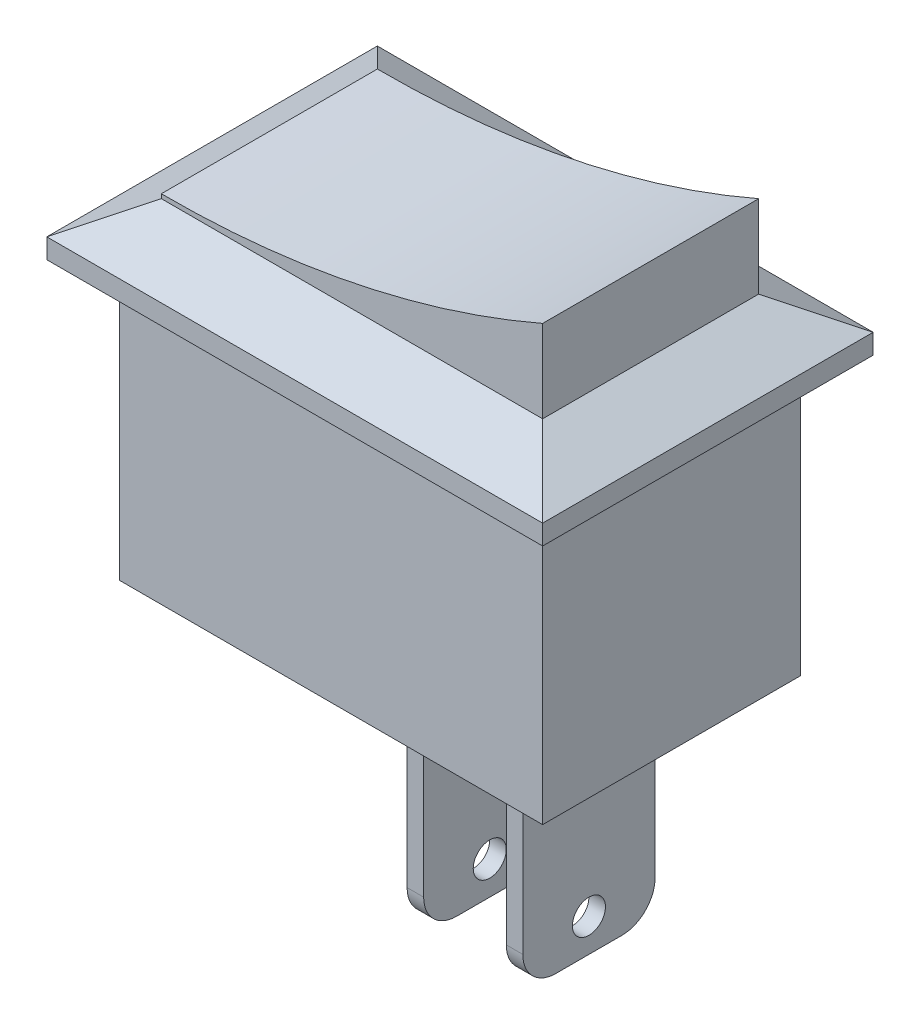
ISO-10303-21;
HEADER;
FILE_DESCRIPTION(('STEP AP214'),'2;1');
FILE_NAME('part.step','',(''),(''),'','','');
FILE_SCHEMA(('AUTOMOTIVE_DESIGN { 1 0 10303 214 1 1 1 1 }'));
ENDSEC;
DATA;
#1=APPLICATION_CONTEXT('core data for automotive mechanical design processes');
#2=APPLICATION_PROTOCOL_DEFINITION('international standard','automotive_design',2000,#1);
#3=PRODUCT_CONTEXT('',#1,'mechanical');
#4=PRODUCT('Part','Part','',(#3));
#5=PRODUCT_RELATED_PRODUCT_CATEGORY('part','',(#4));
#6=PRODUCT_DEFINITION_FORMATION('','',#4);
#7=PRODUCT_DEFINITION_CONTEXT('part definition',#1,'design');
#8=PRODUCT_DEFINITION('design','',#6,#7);
#9=PRODUCT_DEFINITION_SHAPE('','',#8);
#10=(LENGTH_UNIT() NAMED_UNIT(*) SI_UNIT(.MILLI.,.METRE.));
#11=(NAMED_UNIT(*) PLANE_ANGLE_UNIT() SI_UNIT($,.RADIAN.));
#12=(NAMED_UNIT(*) SI_UNIT($,.STERADIAN.) SOLID_ANGLE_UNIT());
#13=UNCERTAINTY_MEASURE_WITH_UNIT(LENGTH_MEASURE(1.E-05),#10,'distance_accuracy_value','');
#14=(GEOMETRIC_REPRESENTATION_CONTEXT(3) GLOBAL_UNCERTAINTY_ASSIGNED_CONTEXT((#13)) GLOBAL_UNIT_ASSIGNED_CONTEXT((#10,
#11,#12)) REPRESENTATION_CONTEXT('',''));
#15=CARTESIAN_POINT('',(0.,0.,0.));
#16=DIRECTION('',(0.,0.,1.));
#17=DIRECTION('',(1.,0.,0.));
#18=AXIS2_PLACEMENT_3D('',#15,#16,#17);
#19=CARTESIAN_POINT('',(-5.76794919243113,12.5,3.26794919243113));
#20=DIRECTION('',(0.,0.,-1.));
#21=DIRECTION('',(-1.,0.,0.));
#22=AXIS2_PLACEMENT_3D('',#19,#20,#21);
#23=PLANE('',#22);
#24=CARTESIAN_POINT('',(-5.62710581970251,38.6897927994851,3.26794919243113));
#25=DIRECTION('',(0.,0.,-1.));
#26=DIRECTION('',(-1.,0.,0.));
#27=AXIS2_PLACEMENT_3D('',#24,#25,#26);
#28=CIRCLE('',#27,28.5613817174435);
#29=CARTESIAN_POINT('',(-5.76794919243111,10.1287583512395,3.26794919243115));
#30=VERTEX_POINT('',#29);
#31=CARTESIAN_POINT('',(5.76794919243114,12.5,3.26794919243115));
#32=VERTEX_POINT('',#31);
#33=EDGE_CURVE('E207',#30,#32,#28,.F.);
#34=ORIENTED_EDGE('',*,*,#33,.F.);
#35=DIRECTION('',(0.,-1.,0.));
#36=VECTOR('',#35,1.);
#37=CARTESIAN_POINT('',(-5.76794919243113,12.5,3.26794919243113));
#38=LINE('',#37,#36);
#39=CARTESIAN_POINT('',(-5.76794919243113,10.,3.26794919243113));
#40=VERTEX_POINT('',#39);
#41=EDGE_CURVE('E226',#30,#40,#38,.T.);
#42=ORIENTED_EDGE('',*,*,#41,.T.);
#43=DIRECTION('',(1.,0.,0.));
#44=VECTOR('',#43,1.);
#45=CARTESIAN_POINT('',(0.,10.,3.26794919243113));
#46=LINE('',#45,#44);
#47=CARTESIAN_POINT('',(5.76794919243113,10.,3.26794919243113));
#48=VERTEX_POINT('',#47);
#49=EDGE_CURVE('E222',#40,#48,#46,.T.);
#50=ORIENTED_EDGE('',*,*,#49,.T.);
#51=DIRECTION('',(0.,-1.,0.));
#52=VECTOR('',#51,1.);
#53=CARTESIAN_POINT('',(5.76794919243113,12.5,3.26794919243113));
#54=LINE('',#53,#52);
#55=EDGE_CURVE('E220',#32,#48,#54,.T.);
#56=ORIENTED_EDGE('',*,*,#55,.F.);
#57=EDGE_LOOP('',(#34,#42,#50,#56));
#58=FACE_BOUND('',#57,.T.);
#59=ADVANCED_FACE('F45',(#58),#23,.F.);
#60=CARTESIAN_POINT('',(0.,0.,0.));
#61=DIRECTION('',(0.,-1.,0.));
#62=DIRECTION('',(0.,0.,-1.));
#63=AXIS2_PLACEMENT_3D('',#60,#61,#62);
#64=PLANE('',#63);
#65=DIRECTION('',(1.,0.,0.));
#66=VECTOR('',#65,1.);
#67=CARTESIAN_POINT('',(-6.4,0.,-3.9));
#68=LINE('',#67,#66);
#69=CARTESIAN_POINT('',(-6.4,0.,-3.9));
#70=VERTEX_POINT('',#69);
#71=CARTESIAN_POINT('',(6.4,0.,-3.9));
#72=VERTEX_POINT('',#71);
#73=EDGE_CURVE('E337',#70,#72,#68,.T.);
#74=ORIENTED_EDGE('',*,*,#73,.T.);
#75=DIRECTION('',(0.,0.,1.));
#76=VECTOR('',#75,1.);
#77=CARTESIAN_POINT('',(6.4,0.,-3.9));
#78=LINE('',#77,#76);
#79=CARTESIAN_POINT('',(6.4,0.,3.9));
#80=VERTEX_POINT('',#79);
#81=EDGE_CURVE('E350',#72,#80,#78,.T.);
#82=ORIENTED_EDGE('',*,*,#81,.T.);
#83=DIRECTION('',(-1.,0.,0.));
#84=VECTOR('',#83,1.);
#85=CARTESIAN_POINT('',(-6.4,0.,3.9));
#86=LINE('',#85,#84);
#87=CARTESIAN_POINT('',(-6.4,0.,3.9));
#88=VERTEX_POINT('',#87);
#89=EDGE_CURVE('E354',#80,#88,#86,.T.);
#90=ORIENTED_EDGE('',*,*,#89,.T.);
#91=DIRECTION('',(0.,0.,-1.));
#92=VECTOR('',#91,1.);
#93=CARTESIAN_POINT('',(-6.4,0.,-3.9));
#94=LINE('',#93,#92);
#95=EDGE_CURVE('E359',#88,#70,#94,.T.);
#96=ORIENTED_EDGE('',*,*,#95,.T.);
#97=EDGE_LOOP('',(#74,#82,#90,#96));
#98=FACE_BOUND('',#97,.T.);
#99=DIRECTION('',(1.,0.,0.));
#100=VECTOR('',#99,1.);
#101=CARTESIAN_POINT('',(3.4,0.,2.));
#102=LINE('',#101,#100);
#103=CARTESIAN_POINT('',(3.4,0.,2.));
#104=VERTEX_POINT('',#103);
#105=CARTESIAN_POINT('',(3.9,0.,2.));
#106=VERTEX_POINT('',#105);
#107=EDGE_CURVE('E309',#104,#106,#102,.T.);
#108=ORIENTED_EDGE('',*,*,#107,.T.);
#109=DIRECTION('',(0.,0.,1.));
#110=VECTOR('',#109,1.);
#111=CARTESIAN_POINT('',(3.9,0.,-2.));
#112=LINE('',#111,#110);
#113=CARTESIAN_POINT('',(3.9,0.,-2.));
#114=VERTEX_POINT('',#113);
#115=EDGE_CURVE('E295',#114,#106,#112,.T.);
#116=ORIENTED_EDGE('',*,*,#115,.F.);
#117=DIRECTION('',(-1.,0.,0.));
#118=VECTOR('',#117,1.);
#119=CARTESIAN_POINT('',(3.9,0.,-2.));
#120=LINE('',#119,#118);
#121=CARTESIAN_POINT('',(3.4,0.,-2.));
#122=VERTEX_POINT('',#121);
#123=EDGE_CURVE('E301',#114,#122,#120,.T.);
#124=ORIENTED_EDGE('',*,*,#123,.T.);
#125=DIRECTION('',(0.,0.,1.));
#126=VECTOR('',#125,1.);
#127=CARTESIAN_POINT('',(3.4,0.,-2.));
#128=LINE('',#127,#126);
#129=EDGE_CURVE('E313',#122,#104,#128,.T.);
#130=ORIENTED_EDGE('',*,*,#129,.T.);
#131=EDGE_LOOP('',(#108,#116,#124,#130));
#132=FACE_BOUND('',#131,.T.);
#133=DIRECTION('',(1.,0.,0.));
#134=VECTOR('',#133,1.);
#135=CARTESIAN_POINT('',(0.400000000000002,0.,1.99999999999998));
#136=LINE('',#135,#134);
#137=CARTESIAN_POINT('',(0.400000000000002,0.,1.99999999999998));
#138=VERTEX_POINT('',#137);
#139=CARTESIAN_POINT('',(0.900000000000002,0.,1.99999999999998));
#140=VERTEX_POINT('',#139);
#141=EDGE_CURVE('E273',#138,#140,#136,.T.);
#142=ORIENTED_EDGE('',*,*,#141,.T.);
#143=DIRECTION('',(0.,0.,1.));
#144=VECTOR('',#143,1.);
#145=CARTESIAN_POINT('',(0.900000000000002,0.,-2.00000000000002));
#146=LINE('',#145,#144);
#147=CARTESIAN_POINT('',(0.900000000000002,0.,-2.00000000000002));
#148=VERTEX_POINT('',#147);
#149=EDGE_CURVE('E260',#148,#140,#146,.T.);
#150=ORIENTED_EDGE('',*,*,#149,.F.);
#151=DIRECTION('',(-1.,0.,0.));
#152=VECTOR('',#151,1.);
#153=CARTESIAN_POINT('',(0.900000000000002,0.,-2.00000000000002));
#154=LINE('',#153,#152);
#155=CARTESIAN_POINT('',(0.400000000000002,0.,-2.00000000000002));
#156=VERTEX_POINT('',#155);
#157=EDGE_CURVE('E265',#148,#156,#154,.T.);
#158=ORIENTED_EDGE('',*,*,#157,.T.);
#159=DIRECTION('',(0.,0.,1.));
#160=VECTOR('',#159,1.);
#161=CARTESIAN_POINT('',(0.400000000000002,0.,-2.00000000000002));
#162=LINE('',#161,#160);
#163=EDGE_CURVE('E277',#156,#138,#162,.T.);
#164=ORIENTED_EDGE('',*,*,#163,.T.);
#165=EDGE_LOOP('',(#142,#150,#158,#164));
#166=FACE_BOUND('',#165,.T.);
#167=ADVANCED_FACE('F502',(#98,#132,#166),#64,.T.);
#168=CARTESIAN_POINT('',(7.5,10.,5.));
#169=DIRECTION('',(-1.,0.,0.));
#170=DIRECTION('',(0.,0.,1.));
#171=AXIS2_PLACEMENT_3D('',#168,#169,#170);
#172=PLANE('',#171);
#173=DIRECTION('',(0.,-1.,0.));
#174=VECTOR('',#173,1.);
#175=CARTESIAN_POINT('',(7.5,10.,-5.));
#176=LINE('',#175,#174);
#177=CARTESIAN_POINT('',(7.5,9.,-5.));
#178=VERTEX_POINT('',#177);
#179=CARTESIAN_POINT('',(7.5,8.4,-5.));
#180=VERTEX_POINT('',#179);
#181=EDGE_CURVE('E403',#178,#180,#176,.T.);
#182=ORIENTED_EDGE('',*,*,#181,.F.);
#183=DIRECTION('',(0.,0.,1.));
#184=VECTOR('',#183,1.);
#185=CARTESIAN_POINT('',(7.5,9.,5.));
#186=LINE('',#185,#184);
#187=CARTESIAN_POINT('',(7.5,9.,5.));
#188=VERTEX_POINT('',#187);
#189=EDGE_CURVE('E426',#178,#188,#186,.T.);
#190=ORIENTED_EDGE('',*,*,#189,.T.);
#191=DIRECTION('',(0.,-1.,0.));
#192=VECTOR('',#191,1.);
#193=CARTESIAN_POINT('',(7.5,10.,5.));
#194=LINE('',#193,#192);
#195=CARTESIAN_POINT('',(7.5,8.4,5.));
#196=VERTEX_POINT('',#195);
#197=EDGE_CURVE('E394',#188,#196,#194,.T.);
#198=ORIENTED_EDGE('',*,*,#197,.T.);
#199=DIRECTION('',(0.,0.,1.));
#200=VECTOR('',#199,1.);
#201=CARTESIAN_POINT('',(7.5,8.4,-5.));
#202=LINE('',#201,#200);
#203=EDGE_CURVE('E369',#180,#196,#202,.T.);
#204=ORIENTED_EDGE('',*,*,#203,.F.);
#205=EDGE_LOOP('',(#182,#190,#198,#204));
#206=FACE_BOUND('',#205,.T.);
#207=ADVANCED_FACE('F532',(#206),#172,.F.);
#208=CARTESIAN_POINT('',(-7.5,10.,-5.));
#209=DIRECTION('',(0.,0.,1.));
#210=DIRECTION('',(1.,0.,0.));
#211=AXIS2_PLACEMENT_3D('',#208,#209,#210);
#212=PLANE('',#211);
#213=DIRECTION('',(0.,-1.,0.));
#214=VECTOR('',#213,1.);
#215=CARTESIAN_POINT('',(-7.5,10.,-5.));
#216=LINE('',#215,#214);
#217=CARTESIAN_POINT('',(-7.5,9.,-5.));
#218=VERTEX_POINT('',#217);
#219=CARTESIAN_POINT('',(-7.5,8.4,-5.));
#220=VERTEX_POINT('',#219);
#221=EDGE_CURVE('E400',#218,#220,#216,.T.);
#222=ORIENTED_EDGE('',*,*,#221,.F.);
#223=DIRECTION('',(1.,0.,0.));
#224=VECTOR('',#223,1.);
#225=CARTESIAN_POINT('',(-7.5,9.,-5.));
#226=LINE('',#225,#224);
#227=EDGE_CURVE('E429',#218,#178,#226,.T.);
#228=ORIENTED_EDGE('',*,*,#227,.T.);
#229=ORIENTED_EDGE('',*,*,#181,.T.);
#230=DIRECTION('',(1.,0.,0.));
#231=VECTOR('',#230,1.);
#232=CARTESIAN_POINT('',(-7.5,8.4,-5.));
#233=LINE('',#232,#231);
#234=EDGE_CURVE('E390',#220,#180,#233,.T.);
#235=ORIENTED_EDGE('',*,*,#234,.F.);
#236=EDGE_LOOP('',(#222,#228,#229,#235));
#237=FACE_BOUND('',#236,.T.);
#238=ADVANCED_FACE('F607',(#237),#212,.F.);
#239=CARTESIAN_POINT('',(-7.5,10.,5.));
#240=DIRECTION('',(1.,0.,0.));
#241=DIRECTION('',(0.,0.,-1.));
#242=AXIS2_PLACEMENT_3D('',#239,#240,#241);
#243=PLANE('',#242);
#244=DIRECTION('',(0.,-1.,0.));
#245=VECTOR('',#244,1.);
#246=CARTESIAN_POINT('',(-7.5,10.,5.));
#247=LINE('',#246,#245);
#248=CARTESIAN_POINT('',(-7.5,9.,5.));
#249=VERTEX_POINT('',#248);
#250=CARTESIAN_POINT('',(-7.5,8.4,5.));
#251=VERTEX_POINT('',#250);
#252=EDGE_CURVE('E397',#249,#251,#247,.T.);
#253=ORIENTED_EDGE('',*,*,#252,.F.);
#254=DIRECTION('',(0.,0.,-1.));
#255=VECTOR('',#254,1.);
#256=CARTESIAN_POINT('',(-7.5,9.,5.));
#257=LINE('',#256,#255);
#258=EDGE_CURVE('E419',#249,#218,#257,.T.);
#259=ORIENTED_EDGE('',*,*,#258,.T.);
#260=ORIENTED_EDGE('',*,*,#221,.T.);
#261=DIRECTION('',(0.,0.,-1.));
#262=VECTOR('',#261,1.);
#263=CARTESIAN_POINT('',(-7.5,8.4,-5.));
#264=LINE('',#263,#262);
#265=EDGE_CURVE('E386',#251,#220,#264,.T.);
#266=ORIENTED_EDGE('',*,*,#265,.F.);
#267=EDGE_LOOP('',(#253,#259,#260,#266));
#268=FACE_BOUND('',#267,.T.);
#269=ADVANCED_FACE('F603',(#268),#243,.F.);
#270=CARTESIAN_POINT('',(-7.5,10.,5.));
#271=DIRECTION('',(0.,0.,-1.));
#272=DIRECTION('',(-1.,0.,0.));
#273=AXIS2_PLACEMENT_3D('',#270,#271,#272);
#274=PLANE('',#273);
#275=ORIENTED_EDGE('',*,*,#197,.F.);
#276=DIRECTION('',(-1.,0.,0.));
#277=VECTOR('',#276,1.);
#278=CARTESIAN_POINT('',(-7.5,9.,5.));
#279=LINE('',#278,#277);
#280=EDGE_CURVE('E423',#188,#249,#279,.T.);
#281=ORIENTED_EDGE('',*,*,#280,.T.);
#282=ORIENTED_EDGE('',*,*,#252,.T.);
#283=DIRECTION('',(-1.,0.,0.));
#284=VECTOR('',#283,1.);
#285=CARTESIAN_POINT('',(-7.5,8.4,5.));
#286=LINE('',#285,#284);
#287=EDGE_CURVE('E382',#196,#251,#286,.T.);
#288=ORIENTED_EDGE('',*,*,#287,.F.);
#289=EDGE_LOOP('',(#275,#281,#282,#288));
#290=FACE_BOUND('',#289,.T.);
#291=ADVANCED_FACE('F598',(#290),#274,.F.);
#292=CARTESIAN_POINT('',(0.,8.4,0.));
#293=DIRECTION('',(0.,1.,0.));
#294=DIRECTION('',(0.,0.,1.));
#295=AXIS2_PLACEMENT_3D('',#292,#293,#294);
#296=PLANE('',#295);
#297=DIRECTION('',(0.,0.,1.));
#298=VECTOR('',#297,1.);
#299=CARTESIAN_POINT('',(6.4,8.4,-3.9));
#300=LINE('',#299,#298);
#301=CARTESIAN_POINT('',(6.4,8.4,-3.9));
#302=VERTEX_POINT('',#301);
#303=CARTESIAN_POINT('',(6.4,8.4,3.9));
#304=VERTEX_POINT('',#303);
#305=EDGE_CURVE('E332',#302,#304,#300,.T.);
#306=ORIENTED_EDGE('',*,*,#305,.F.);
#307=DIRECTION('',(1.,0.,0.));
#308=VECTOR('',#307,1.);
#309=CARTESIAN_POINT('',(-6.4,8.4,-3.9));
#310=LINE('',#309,#308);
#311=CARTESIAN_POINT('',(-6.4,8.4,-3.9));
#312=VERTEX_POINT('',#311);
#313=EDGE_CURVE('E345',#312,#302,#310,.T.);
#314=ORIENTED_EDGE('',*,*,#313,.F.);
#315=DIRECTION('',(0.,0.,-1.));
#316=VECTOR('',#315,1.);
#317=CARTESIAN_POINT('',(-6.4,8.4,-3.9));
#318=LINE('',#317,#316);
#319=CARTESIAN_POINT('',(-6.4,8.4,3.9));
#320=VERTEX_POINT('',#319);
#321=EDGE_CURVE('E341',#320,#312,#318,.T.);
#322=ORIENTED_EDGE('',*,*,#321,.F.);
#323=DIRECTION('',(-1.,0.,0.));
#324=VECTOR('',#323,1.);
#325=CARTESIAN_POINT('',(-6.4,8.4,3.9));
#326=LINE('',#325,#324);
#327=EDGE_CURVE('E336',#304,#320,#326,.T.);
#328=ORIENTED_EDGE('',*,*,#327,.F.);
#329=EDGE_LOOP('',(#306,#314,#322,#328));
#330=FACE_BOUND('',#329,.T.);
#331=ORIENTED_EDGE('',*,*,#203,.T.);
#332=ORIENTED_EDGE('',*,*,#287,.T.);
#333=ORIENTED_EDGE('',*,*,#265,.T.);
#334=ORIENTED_EDGE('',*,*,#234,.T.);
#335=EDGE_LOOP('',(#331,#332,#333,#334));
#336=FACE_BOUND('',#335,.T.);
#337=ADVANCED_FACE('F595',(#330,#336),#296,.F.);
#338=CARTESIAN_POINT('',(6.4,8.4,-3.9));
#339=DIRECTION('',(1.,0.,0.));
#340=DIRECTION('',(0.,0.,-1.));
#341=AXIS2_PLACEMENT_3D('',#338,#339,#340);
#342=PLANE('',#341);
#343=ORIENTED_EDGE('',*,*,#81,.F.);
#344=DIRECTION('',(0.,-1.,0.));
#345=VECTOR('',#344,1.);
#346=CARTESIAN_POINT('',(6.4,8.4,-3.9));
#347=LINE('',#346,#345);
#348=EDGE_CURVE('E366',#302,#72,#347,.T.);
#349=ORIENTED_EDGE('',*,*,#348,.F.);
#350=ORIENTED_EDGE('',*,*,#305,.T.);
#351=DIRECTION('',(0.,-1.,0.));
#352=VECTOR('',#351,1.);
#353=CARTESIAN_POINT('',(6.4,8.4,3.9));
#354=LINE('',#353,#352);
#355=EDGE_CURVE('E349',#304,#80,#354,.T.);
#356=ORIENTED_EDGE('',*,*,#355,.T.);
#357=EDGE_LOOP('',(#343,#349,#350,#356));
#358=FACE_BOUND('',#357,.T.);
#359=ADVANCED_FACE('F583',(#358),#342,.T.);
#360=CARTESIAN_POINT('',(-6.4,8.4,-3.9));
#361=DIRECTION('',(0.,0.,-1.));
#362=DIRECTION('',(-1.,0.,0.));
#363=AXIS2_PLACEMENT_3D('',#360,#361,#362);
#364=PLANE('',#363);
#365=ORIENTED_EDGE('',*,*,#73,.F.);
#366=DIRECTION('',(0.,-1.,0.));
#367=VECTOR('',#366,1.);
#368=CARTESIAN_POINT('',(-6.4,8.4,-3.9));
#369=LINE('',#368,#367);
#370=EDGE_CURVE('E370',#312,#70,#369,.T.);
#371=ORIENTED_EDGE('',*,*,#370,.F.);
#372=ORIENTED_EDGE('',*,*,#313,.T.);
#373=ORIENTED_EDGE('',*,*,#348,.T.);
#374=EDGE_LOOP('',(#365,#371,#372,#373));
#375=FACE_BOUND('',#374,.T.);
#376=ADVANCED_FACE('F579',(#375),#364,.T.);
#377=CARTESIAN_POINT('',(-6.4,8.4,-3.9));
#378=DIRECTION('',(-1.,0.,0.));
#379=DIRECTION('',(0.,0.,1.));
#380=AXIS2_PLACEMENT_3D('',#377,#378,#379);
#381=PLANE('',#380);
#382=ORIENTED_EDGE('',*,*,#95,.F.);
#383=DIRECTION('',(0.,-1.,0.));
#384=VECTOR('',#383,1.);
#385=CARTESIAN_POINT('',(-6.4,8.4,3.9));
#386=LINE('',#385,#384);
#387=EDGE_CURVE('E373',#320,#88,#386,.T.);
#388=ORIENTED_EDGE('',*,*,#387,.F.);
#389=ORIENTED_EDGE('',*,*,#321,.T.);
#390=ORIENTED_EDGE('',*,*,#370,.T.);
#391=EDGE_LOOP('',(#382,#388,#389,#390));
#392=FACE_BOUND('',#391,.T.);
#393=ADVANCED_FACE('F582',(#392),#381,.T.);
#394=CARTESIAN_POINT('',(-6.4,8.4,3.9));
#395=DIRECTION('',(0.,0.,1.));
#396=DIRECTION('',(1.,0.,0.));
#397=AXIS2_PLACEMENT_3D('',#394,#395,#396);
#398=PLANE('',#397);
#399=ORIENTED_EDGE('',*,*,#89,.F.);
#400=ORIENTED_EDGE('',*,*,#355,.F.);
#401=ORIENTED_EDGE('',*,*,#327,.T.);
#402=ORIENTED_EDGE('',*,*,#387,.T.);
#403=EDGE_LOOP('',(#399,#400,#401,#402));
#404=FACE_BOUND('',#403,.T.);
#405=ADVANCED_FACE('F587',(#404),#398,.T.);
#406=CARTESIAN_POINT('',(5.76794919243113,10.,0.));
#407=DIRECTION('',(-0.500000000000002,-0.866025403784438,0.));
#408=DIRECTION('',(0.,0.,-1.));
#409=AXIS2_PLACEMENT_3D('',#406,#407,#408);
#410=PLANE('',#409);
#411=DIRECTION('',(0.654653670707977,-0.377964473009229,0.654653670707977));
#412=VECTOR('',#411,1.);
#413=CARTESIAN_POINT('',(4.36739953853207,10.8086077196921,1.86739953853208));
#414=LINE('',#413,#412);
#415=EDGE_CURVE('E439',#188,#48,#414,.F.);
#416=ORIENTED_EDGE('',*,*,#415,.F.);
#417=ORIENTED_EDGE('',*,*,#189,.F.);
#418=DIRECTION('',(0.654653670707977,-0.377964473009229,-0.654653670707977));
#419=VECTOR('',#418,1.);
#420=CARTESIAN_POINT('',(3.2959709671035,11.4271972938238,-0.795970967103504));
#421=LINE('',#420,#419);
#422=CARTESIAN_POINT('',(5.76794919243113,10.,-3.26794919243113));
#423=VERTEX_POINT('',#422);
#424=EDGE_CURVE('E355',#423,#178,#421,.T.);
#425=ORIENTED_EDGE('',*,*,#424,.F.);
#426=DIRECTION('',(0.,0.,-1.));
#427=VECTOR('',#426,1.);
#428=CARTESIAN_POINT('',(5.76794919243113,10.,0.));
#429=LINE('',#428,#427);
#430=EDGE_CURVE('E410',#48,#423,#429,.T.);
#431=ORIENTED_EDGE('',*,*,#430,.F.);
#432=EDGE_LOOP('',(#416,#417,#425,#431));
#433=FACE_BOUND('',#432,.T.);
#434=ADVANCED_FACE('F591',(#433),#410,.F.);
#435=CARTESIAN_POINT('',(0.,10.,-3.26794919243113));
#436=DIRECTION('',(0.,-0.866025403784438,0.500000000000002));
#437=DIRECTION('',(-1.,0.,0.));
#438=AXIS2_PLACEMENT_3D('',#435,#436,#437);
#439=PLANE('',#438);
#440=ORIENTED_EDGE('',*,*,#424,.T.);
#441=ORIENTED_EDGE('',*,*,#227,.F.);
#442=DIRECTION('',(0.654653670707977,0.377964473009229,0.654653670707977));
#443=VECTOR('',#442,1.);
#444=CARTESIAN_POINT('',(-3.2959709671035,11.4271972938238,-0.795970967103504));
#445=LINE('',#444,#443);
#446=CARTESIAN_POINT('',(-5.76794919243113,10.,-3.26794919243113));
#447=VERTEX_POINT('',#446);
#448=EDGE_CURVE('E436',#447,#218,#445,.F.);
#449=ORIENTED_EDGE('',*,*,#448,.F.);
#450=DIRECTION('',(-1.,0.,0.));
#451=VECTOR('',#450,1.);
#452=CARTESIAN_POINT('',(0.,10.,-3.26794919243113));
#453=LINE('',#452,#451);
#454=EDGE_CURVE('E406',#423,#447,#453,.T.);
#455=ORIENTED_EDGE('',*,*,#454,.F.);
#456=EDGE_LOOP('',(#440,#441,#449,#455));
#457=FACE_BOUND('',#456,.T.);
#458=ADVANCED_FACE('F628',(#457),#439,.F.);
#459=CARTESIAN_POINT('',(0.,10.,3.26794919243113));
#460=DIRECTION('',(0.,-0.866025403784438,-0.500000000000002));
#461=DIRECTION('',(1.,0.,0.));
#462=AXIS2_PLACEMENT_3D('',#459,#460,#461);
#463=PLANE('',#462);
#464=ORIENTED_EDGE('',*,*,#415,.T.);
#465=ORIENTED_EDGE('',*,*,#49,.F.);
#466=DIRECTION('',(-0.654653670707977,-0.377964473009229,0.654653670707977));
#467=VECTOR('',#466,1.);
#468=CARTESIAN_POINT('',(-3.2959709671035,11.4271972938238,0.795970967103506));
#469=LINE('',#468,#467);
#470=EDGE_CURVE('E331',#249,#40,#469,.F.);
#471=ORIENTED_EDGE('',*,*,#470,.F.);
#472=ORIENTED_EDGE('',*,*,#280,.F.);
#473=EDGE_LOOP('',(#464,#465,#471,#472));
#474=FACE_BOUND('',#473,.T.);
#475=ADVANCED_FACE('F621',(#474),#463,.F.);
#476=CARTESIAN_POINT('',(-5.76794919243113,10.,0.));
#477=DIRECTION('',(0.500000000000002,-0.866025403784438,0.));
#478=DIRECTION('',(0.,0.,1.));
#479=AXIS2_PLACEMENT_3D('',#476,#477,#478);
#480=PLANE('',#479);
#481=ORIENTED_EDGE('',*,*,#448,.T.);
#482=ORIENTED_EDGE('',*,*,#258,.F.);
#483=ORIENTED_EDGE('',*,*,#470,.T.);
#484=DIRECTION('',(0.,0.,1.));
#485=VECTOR('',#484,1.);
#486=CARTESIAN_POINT('',(-5.76794919243113,10.,0.));
#487=LINE('',#486,#485);
#488=EDGE_CURVE('E415',#447,#40,#487,.T.);
#489=ORIENTED_EDGE('',*,*,#488,.F.);
#490=EDGE_LOOP('',(#481,#482,#483,#489));
#491=FACE_BOUND('',#490,.T.);
#492=ADVANCED_FACE('F577',(#491),#480,.F.);
#493=CARTESIAN_POINT('',(3.9,-6.6,-2.));
#494=DIRECTION('',(-1.,0.,0.));
#495=DIRECTION('',(0.,0.,1.));
#496=AXIS2_PLACEMENT_3D('',#493,#494,#495);
#497=PLANE('',#496);
#498=CARTESIAN_POINT('',(3.9,-5.6,0.));
#499=DIRECTION('',(-1.,0.,0.));
#500=DIRECTION('',(0.,0.,1.));
#501=AXIS2_PLACEMENT_3D('',#498,#499,#500);
#502=CIRCLE('',#501,0.5);
#503=CARTESIAN_POINT('',(3.9,-5.6,0.499999999999979));
#504=VERTEX_POINT('',#503);
#505=EDGE_CURVE('E256',#504,#504,#502,.T.);
#506=ORIENTED_EDGE('',*,*,#505,.T.);
#507=EDGE_LOOP('',(#506));
#508=FACE_BOUND('',#507,.T.);
#509=DIRECTION('',(0.,0.,1.));
#510=VECTOR('',#509,1.);
#511=CARTESIAN_POINT('',(3.9,-6.6,-2.));
#512=LINE('',#511,#510);
#513=CARTESIAN_POINT('',(3.9,-6.6,-1.));
#514=VERTEX_POINT('',#513);
#515=CARTESIAN_POINT('',(3.9,-6.6,1.));
#516=VERTEX_POINT('',#515);
#517=EDGE_CURVE('E296',#514,#516,#512,.T.);
#518=ORIENTED_EDGE('',*,*,#517,.F.);
#519=CARTESIAN_POINT('',(3.9,-5.6,-1.));
#520=DIRECTION('',(-1.,0.,0.));
#521=DIRECTION('',(0.,0.,1.));
#522=AXIS2_PLACEMENT_3D('',#519,#520,#521);
#523=CIRCLE('',#522,1.);
#524=CARTESIAN_POINT('',(3.9,-5.6,-2.));
#525=VERTEX_POINT('',#524);
#526=EDGE_CURVE('E464',#514,#525,#523,.F.);
#527=ORIENTED_EDGE('',*,*,#526,.T.);
#528=DIRECTION('',(0.,1.,0.));
#529=VECTOR('',#528,1.);
#530=CARTESIAN_POINT('',(3.9,-6.6,-2.));
#531=LINE('',#530,#529);
#532=EDGE_CURVE('E305',#525,#114,#531,.T.);
#533=ORIENTED_EDGE('',*,*,#532,.T.);
#534=ORIENTED_EDGE('',*,*,#115,.T.);
#535=DIRECTION('',(0.,1.,0.));
#536=VECTOR('',#535,1.);
#537=CARTESIAN_POINT('',(3.9,-6.6,2.));
#538=LINE('',#537,#536);
#539=CARTESIAN_POINT('',(3.9,-5.6,2.));
#540=VERTEX_POINT('',#539);
#541=EDGE_CURVE('E328',#540,#106,#538,.T.);
#542=ORIENTED_EDGE('',*,*,#541,.F.);
#543=CARTESIAN_POINT('',(3.9,-5.6,1.));
#544=DIRECTION('',(-1.,0.,0.));
#545=DIRECTION('',(0.,0.,1.));
#546=AXIS2_PLACEMENT_3D('',#543,#544,#545);
#547=CIRCLE('',#546,1.);
#548=EDGE_CURVE('E461',#540,#516,#547,.F.);
#549=ORIENTED_EDGE('',*,*,#548,.T.);
#550=EDGE_LOOP('',(#518,#527,#533,#534,#542,#549));
#551=FACE_BOUND('',#550,.T.);
#552=ADVANCED_FACE('F573',(#508,#551),#497,.F.);
#553=CARTESIAN_POINT('',(3.4,-6.6,2.));
#554=DIRECTION('',(0.,0.,1.));
#555=DIRECTION('',(1.,0.,0.));
#556=AXIS2_PLACEMENT_3D('',#553,#554,#555);
#557=PLANE('',#556);
#558=DIRECTION('',(0.,1.,0.));
#559=VECTOR('',#558,1.);
#560=CARTESIAN_POINT('',(3.4,-6.6,2.));
#561=LINE('',#560,#559);
#562=CARTESIAN_POINT('',(3.4,-5.6,2.));
#563=VERTEX_POINT('',#562);
#564=EDGE_CURVE('E325',#563,#104,#561,.T.);
#565=ORIENTED_EDGE('',*,*,#564,.F.);
#566=DIRECTION('',(1.,0.,0.));
#567=VECTOR('',#566,1.);
#568=CARTESIAN_POINT('',(3.9,-5.6,2.));
#569=LINE('',#568,#567);
#570=EDGE_CURVE('E467',#563,#540,#569,.T.);
#571=ORIENTED_EDGE('',*,*,#570,.T.);
#572=ORIENTED_EDGE('',*,*,#541,.T.);
#573=ORIENTED_EDGE('',*,*,#107,.F.);
#574=EDGE_LOOP('',(#565,#571,#572,#573));
#575=FACE_BOUND('',#574,.T.);
#576=ADVANCED_FACE('F569',(#575),#557,.T.);
#577=CARTESIAN_POINT('',(3.4,-6.6,-2.));
#578=DIRECTION('',(-1.,0.,0.));
#579=DIRECTION('',(0.,0.,1.));
#580=AXIS2_PLACEMENT_3D('',#577,#578,#579);
#581=PLANE('',#580);
#582=CARTESIAN_POINT('',(3.4,-5.6,0.));
#583=DIRECTION('',(-1.,0.,0.));
#584=DIRECTION('',(0.,0.,1.));
#585=AXIS2_PLACEMENT_3D('',#582,#583,#584);
#586=CIRCLE('',#585,0.5);
#587=CARTESIAN_POINT('',(3.4,-5.6,0.499999999999979));
#588=VERTEX_POINT('',#587);
#589=EDGE_CURVE('E252',#588,#588,#586,.T.);
#590=ORIENTED_EDGE('',*,*,#589,.F.);
#591=EDGE_LOOP('',(#590));
#592=FACE_BOUND('',#591,.T.);
#593=DIRECTION('',(0.,1.,0.));
#594=VECTOR('',#593,1.);
#595=CARTESIAN_POINT('',(3.4,-6.6,-2.));
#596=LINE('',#595,#594);
#597=CARTESIAN_POINT('',(3.4,-5.6,-2.));
#598=VERTEX_POINT('',#597);
#599=EDGE_CURVE('E322',#598,#122,#596,.T.);
#600=ORIENTED_EDGE('',*,*,#599,.F.);
#601=CARTESIAN_POINT('',(3.4,-5.6,-1.));
#602=DIRECTION('',(-1.,0.,0.));
#603=DIRECTION('',(0.,0.,1.));
#604=AXIS2_PLACEMENT_3D('',#601,#602,#603);
#605=CIRCLE('',#604,1.);
#606=CARTESIAN_POINT('',(3.4,-6.6,-1.));
#607=VERTEX_POINT('',#606);
#608=EDGE_CURVE('E452',#598,#607,#605,.T.);
#609=ORIENTED_EDGE('',*,*,#608,.T.);
#610=DIRECTION('',(0.,0.,1.));
#611=VECTOR('',#610,1.);
#612=CARTESIAN_POINT('',(3.4,-6.6,-2.));
#613=LINE('',#612,#611);
#614=CARTESIAN_POINT('',(3.4,-6.6,1.));
#615=VERTEX_POINT('',#614);
#616=EDGE_CURVE('E300',#607,#615,#613,.T.);
#617=ORIENTED_EDGE('',*,*,#616,.T.);
#618=CARTESIAN_POINT('',(3.4,-5.6,1.));
#619=DIRECTION('',(-1.,0.,0.));
#620=DIRECTION('',(0.,0.,1.));
#621=AXIS2_PLACEMENT_3D('',#618,#619,#620);
#622=CIRCLE('',#621,1.);
#623=EDGE_CURVE('E449',#615,#563,#622,.T.);
#624=ORIENTED_EDGE('',*,*,#623,.T.);
#625=ORIENTED_EDGE('',*,*,#564,.T.);
#626=ORIENTED_EDGE('',*,*,#129,.F.);
#627=EDGE_LOOP('',(#600,#609,#617,#624,#625,#626));
#628=FACE_BOUND('',#627,.T.);
#629=ADVANCED_FACE('F565',(#592,#628),#581,.T.);
#630=CARTESIAN_POINT('',(3.9,-6.6,-2.));
#631=DIRECTION('',(0.,0.,-1.));
#632=DIRECTION('',(-1.,0.,0.));
#633=AXIS2_PLACEMENT_3D('',#630,#631,#632);
#634=PLANE('',#633);
#635=ORIENTED_EDGE('',*,*,#532,.F.);
#636=DIRECTION('',(-1.,0.,0.));
#637=VECTOR('',#636,1.);
#638=CARTESIAN_POINT('',(3.4,-5.6,-2.));
#639=LINE('',#638,#637);
#640=EDGE_CURVE('E432',#525,#598,#639,.T.);
#641=ORIENTED_EDGE('',*,*,#640,.T.);
#642=ORIENTED_EDGE('',*,*,#599,.T.);
#643=ORIENTED_EDGE('',*,*,#123,.F.);
#644=EDGE_LOOP('',(#635,#641,#642,#643));
#645=FACE_BOUND('',#644,.T.);
#646=ADVANCED_FACE('F561',(#645),#634,.T.);
#647=CARTESIAN_POINT('',(0.,-6.6,0.));
#648=DIRECTION('',(0.,1.,0.));
#649=DIRECTION('',(-1.,0.,0.));
#650=AXIS2_PLACEMENT_3D('',#647,#648,#649);
#651=PLANE('',#650);
#652=ORIENTED_EDGE('',*,*,#616,.F.);
#653=DIRECTION('',(-1.,0.,0.));
#654=VECTOR('',#653,1.);
#655=CARTESIAN_POINT('',(3.9,-6.6,-1.));
#656=LINE('',#655,#654);
#657=EDGE_CURVE('E458',#607,#514,#656,.F.);
#658=ORIENTED_EDGE('',*,*,#657,.T.);
#659=ORIENTED_EDGE('',*,*,#517,.T.);
#660=DIRECTION('',(1.,0.,0.));
#661=VECTOR('',#660,1.);
#662=CARTESIAN_POINT('',(3.4,-6.6,1.));
#663=LINE('',#662,#661);
#664=EDGE_CURVE('E455',#516,#615,#663,.F.);
#665=ORIENTED_EDGE('',*,*,#664,.T.);
#666=EDGE_LOOP('',(#652,#658,#659,#665));
#667=FACE_BOUND('',#666,.T.);
#668=ADVANCED_FACE('F557',(#667),#651,.F.);
#669=CARTESIAN_POINT('',(0.900000000000002,-6.6,-2.00000000000002));
#670=DIRECTION('',(-1.,0.,0.));
#671=DIRECTION('',(0.,0.,1.));
#672=AXIS2_PLACEMENT_3D('',#669,#670,#671);
#673=PLANE('',#672);
#674=CARTESIAN_POINT('',(0.900000000000002,-5.6,0.));
#675=DIRECTION('',(-1.,0.,0.));
#676=DIRECTION('',(0.,0.,1.));
#677=AXIS2_PLACEMENT_3D('',#674,#675,#676);
#678=CIRCLE('',#677,0.5);
#679=CARTESIAN_POINT('',(0.900000000000002,-5.6,0.499999999999979));
#680=VERTEX_POINT('',#679);
#681=EDGE_CURVE('E248',#680,#680,#678,.T.);
#682=ORIENTED_EDGE('',*,*,#681,.T.);
#683=EDGE_LOOP('',(#682));
#684=FACE_BOUND('',#683,.T.);
#685=DIRECTION('',(0.,0.,1.));
#686=VECTOR('',#685,1.);
#687=CARTESIAN_POINT('',(0.900000000000002,-6.6,-2.00000000000002));
#688=LINE('',#687,#686);
#689=CARTESIAN_POINT('',(0.900000000000002,-6.6,-1.00000000000002));
#690=VERTEX_POINT('',#689);
#691=CARTESIAN_POINT('',(0.900000000000002,-6.6,0.999999999999979));
#692=VERTEX_POINT('',#691);
#693=EDGE_CURVE('E261',#690,#692,#688,.T.);
#694=ORIENTED_EDGE('',*,*,#693,.F.);
#695=CARTESIAN_POINT('',(0.900000000000002,-5.6,-1.00000000000002));
#696=DIRECTION('',(-1.,0.,0.));
#697=DIRECTION('',(0.,0.,1.));
#698=AXIS2_PLACEMENT_3D('',#695,#696,#697);
#699=CIRCLE('',#698,1.);
#700=CARTESIAN_POINT('',(0.900000000000002,-5.6,-2.00000000000002));
#701=VERTEX_POINT('',#700);
#702=EDGE_CURVE('E489',#690,#701,#699,.F.);
#703=ORIENTED_EDGE('',*,*,#702,.T.);
#704=DIRECTION('',(0.,1.,0.));
#705=VECTOR('',#704,1.);
#706=CARTESIAN_POINT('',(0.900000000000002,-6.6,-2.00000000000002));
#707=LINE('',#706,#705);
#708=EDGE_CURVE('E269',#701,#148,#707,.T.);
#709=ORIENTED_EDGE('',*,*,#708,.T.);
#710=ORIENTED_EDGE('',*,*,#149,.T.);
#711=DIRECTION('',(0.,1.,0.));
#712=VECTOR('',#711,1.);
#713=CARTESIAN_POINT('',(0.900000000000002,-6.6,1.99999999999998));
#714=LINE('',#713,#712);
#715=CARTESIAN_POINT('',(0.900000000000002,-5.6,1.99999999999998));
#716=VERTEX_POINT('',#715);
#717=EDGE_CURVE('E292',#716,#140,#714,.T.);
#718=ORIENTED_EDGE('',*,*,#717,.F.);
#719=CARTESIAN_POINT('',(0.900000000000002,-5.6,0.999999999999979));
#720=DIRECTION('',(-1.,0.,0.));
#721=DIRECTION('',(0.,0.,1.));
#722=AXIS2_PLACEMENT_3D('',#719,#720,#721);
#723=CIRCLE('',#722,1.);
#724=EDGE_CURVE('E61',#716,#692,#723,.F.);
#725=ORIENTED_EDGE('',*,*,#724,.T.);
#726=EDGE_LOOP('',(#694,#703,#709,#710,#718,#725));
#727=FACE_BOUND('',#726,.T.);
#728=ADVANCED_FACE('F497',(#684,#727),#673,.F.);
#729=CARTESIAN_POINT('',(0.400000000000002,-6.6,1.99999999999998));
#730=DIRECTION('',(0.,0.,1.));
#731=DIRECTION('',(1.,0.,0.));
#732=AXIS2_PLACEMENT_3D('',#729,#730,#731);
#733=PLANE('',#732);
#734=DIRECTION('',(0.,1.,0.));
#735=VECTOR('',#734,1.);
#736=CARTESIAN_POINT('',(0.400000000000002,-6.6,1.99999999999998));
#737=LINE('',#736,#735);
#738=CARTESIAN_POINT('',(0.400000000000002,-5.6,1.99999999999998));
#739=VERTEX_POINT('',#738);
#740=EDGE_CURVE('E289',#739,#138,#737,.T.);
#741=ORIENTED_EDGE('',*,*,#740,.F.);
#742=DIRECTION('',(1.,0.,0.));
#743=VECTOR('',#742,1.);
#744=CARTESIAN_POINT('',(0.900000000000002,-5.6,1.99999999999998));
#745=LINE('',#744,#743);
#746=EDGE_CURVE('E54',#739,#716,#745,.T.);
#747=ORIENTED_EDGE('',*,*,#746,.T.);
#748=ORIENTED_EDGE('',*,*,#717,.T.);
#749=ORIENTED_EDGE('',*,*,#141,.F.);
#750=EDGE_LOOP('',(#741,#747,#748,#749));
#751=FACE_BOUND('',#750,.T.);
#752=ADVANCED_FACE('F494',(#751),#733,.T.);
#753=CARTESIAN_POINT('',(0.400000000000002,-6.6,-2.00000000000002));
#754=DIRECTION('',(-1.,0.,0.));
#755=DIRECTION('',(0.,0.,1.));
#756=AXIS2_PLACEMENT_3D('',#753,#754,#755);
#757=PLANE('',#756);
#758=CARTESIAN_POINT('',(0.400000000000002,-5.6,0.));
#759=DIRECTION('',(-1.,0.,0.));
#760=DIRECTION('',(0.,0.,1.));
#761=AXIS2_PLACEMENT_3D('',#758,#759,#760);
#762=CIRCLE('',#761,0.5);
#763=CARTESIAN_POINT('',(0.400000000000002,-5.6,0.499999999999979));
#764=VERTEX_POINT('',#763);
#765=EDGE_CURVE('E244',#764,#764,#762,.T.);
#766=ORIENTED_EDGE('',*,*,#765,.F.);
#767=EDGE_LOOP('',(#766));
#768=FACE_BOUND('',#767,.T.);
#769=DIRECTION('',(0.,1.,0.));
#770=VECTOR('',#769,1.);
#771=CARTESIAN_POINT('',(0.400000000000002,-6.6,-2.00000000000002));
#772=LINE('',#771,#770);
#773=CARTESIAN_POINT('',(0.400000000000002,-5.6,-2.00000000000002));
#774=VERTEX_POINT('',#773);
#775=EDGE_CURVE('E286',#774,#156,#772,.T.);
#776=ORIENTED_EDGE('',*,*,#775,.F.);
#777=CARTESIAN_POINT('',(0.400000000000002,-5.6,-1.00000000000002));
#778=DIRECTION('',(-1.,0.,0.));
#779=DIRECTION('',(0.,0.,1.));
#780=AXIS2_PLACEMENT_3D('',#777,#778,#779);
#781=CIRCLE('',#780,1.);
#782=CARTESIAN_POINT('',(0.400000000000002,-6.6,-1.00000000000002));
#783=VERTEX_POINT('',#782);
#784=EDGE_CURVE('E478',#774,#783,#781,.T.);
#785=ORIENTED_EDGE('',*,*,#784,.T.);
#786=DIRECTION('',(0.,0.,1.));
#787=VECTOR('',#786,1.);
#788=CARTESIAN_POINT('',(0.400000000000002,-6.6,-2.00000000000002));
#789=LINE('',#788,#787);
#790=CARTESIAN_POINT('',(0.400000000000002,-6.6,0.999999999999979));
#791=VERTEX_POINT('',#790);
#792=EDGE_CURVE('E264',#783,#791,#789,.T.);
#793=ORIENTED_EDGE('',*,*,#792,.T.);
#794=CARTESIAN_POINT('',(0.400000000000002,-5.6,0.999999999999979));
#795=DIRECTION('',(-1.,0.,0.));
#796=DIRECTION('',(0.,0.,1.));
#797=AXIS2_PLACEMENT_3D('',#794,#795,#796);
#798=CIRCLE('',#797,1.);
#799=EDGE_CURVE('E475',#791,#739,#798,.T.);
#800=ORIENTED_EDGE('',*,*,#799,.T.);
#801=ORIENTED_EDGE('',*,*,#740,.T.);
#802=ORIENTED_EDGE('',*,*,#163,.F.);
#803=EDGE_LOOP('',(#776,#785,#793,#800,#801,#802));
#804=FACE_BOUND('',#803,.T.);
#805=ADVANCED_FACE('F509',(#768,#804),#757,.T.);
#806=CARTESIAN_POINT('',(0.900000000000002,-6.6,-2.00000000000002));
#807=DIRECTION('',(0.,0.,-1.));
#808=DIRECTION('',(-1.,0.,0.));
#809=AXIS2_PLACEMENT_3D('',#806,#807,#808);
#810=PLANE('',#809);
#811=ORIENTED_EDGE('',*,*,#708,.F.);
#812=DIRECTION('',(-1.,0.,0.));
#813=VECTOR('',#812,1.);
#814=CARTESIAN_POINT('',(0.400000000000002,-5.6,-2.00000000000002));
#815=LINE('',#814,#813);
#816=EDGE_CURVE('E471',#701,#774,#815,.T.);
#817=ORIENTED_EDGE('',*,*,#816,.T.);
#818=ORIENTED_EDGE('',*,*,#775,.T.);
#819=ORIENTED_EDGE('',*,*,#157,.F.);
#820=EDGE_LOOP('',(#811,#817,#818,#819));
#821=FACE_BOUND('',#820,.T.);
#822=ADVANCED_FACE('F505',(#821),#810,.T.);
#823=CARTESIAN_POINT('',(0.,-6.6,0.));
#824=DIRECTION('',(0.,1.,0.));
#825=DIRECTION('',(-1.,0.,0.));
#826=AXIS2_PLACEMENT_3D('',#823,#824,#825);
#827=PLANE('',#826);
#828=ORIENTED_EDGE('',*,*,#792,.F.);
#829=DIRECTION('',(-1.,0.,0.));
#830=VECTOR('',#829,1.);
#831=CARTESIAN_POINT('',(0.900000000000002,-6.6,-1.00000000000002));
#832=LINE('',#831,#830);
#833=EDGE_CURVE('E484',#783,#690,#832,.F.);
#834=ORIENTED_EDGE('',*,*,#833,.T.);
#835=ORIENTED_EDGE('',*,*,#693,.T.);
#836=DIRECTION('',(1.,0.,0.));
#837=VECTOR('',#836,1.);
#838=CARTESIAN_POINT('',(0.400000000000002,-6.6,0.999999999999979));
#839=LINE('',#838,#837);
#840=EDGE_CURVE('E481',#692,#791,#839,.F.);
#841=ORIENTED_EDGE('',*,*,#840,.T.);
#842=EDGE_LOOP('',(#828,#834,#835,#841));
#843=FACE_BOUND('',#842,.T.);
#844=ADVANCED_FACE('F512',(#843),#827,.F.);
#845=CARTESIAN_POINT('',(3.9,-5.6,-1.));
#846=DIRECTION('',(1.,0.,0.));
#847=DIRECTION('',(0.,0.,-1.));
#848=AXIS2_PLACEMENT_3D('',#845,#846,#847);
#849=CYLINDRICAL_SURFACE('',#848,1.);
#850=ORIENTED_EDGE('',*,*,#526,.F.);
#851=ORIENTED_EDGE('',*,*,#657,.F.);
#852=ORIENTED_EDGE('',*,*,#608,.F.);
#853=ORIENTED_EDGE('',*,*,#640,.F.);
#854=EDGE_LOOP('',(#850,#851,#852,#853));
#855=FACE_BOUND('',#854,.T.);
#856=ADVANCED_FACE('F524',(#855),#849,.T.);
#857=CARTESIAN_POINT('',(3.4,-5.6,1.));
#858=DIRECTION('',(-1.,0.,0.));
#859=DIRECTION('',(0.,0.,1.));
#860=AXIS2_PLACEMENT_3D('',#857,#858,#859);
#861=CYLINDRICAL_SURFACE('',#860,1.);
#862=ORIENTED_EDGE('',*,*,#623,.F.);
#863=ORIENTED_EDGE('',*,*,#664,.F.);
#864=ORIENTED_EDGE('',*,*,#548,.F.);
#865=ORIENTED_EDGE('',*,*,#570,.F.);
#866=EDGE_LOOP('',(#862,#863,#864,#865));
#867=FACE_BOUND('',#866,.T.);
#868=ADVANCED_FACE('F518',(#867),#861,.T.);
#869=CARTESIAN_POINT('',(0.900000000000002,-5.6,-1.00000000000002));
#870=DIRECTION('',(1.,0.,0.));
#871=DIRECTION('',(0.,0.,-1.));
#872=AXIS2_PLACEMENT_3D('',#869,#870,#871);
#873=CYLINDRICAL_SURFACE('',#872,1.);
#874=ORIENTED_EDGE('',*,*,#702,.F.);
#875=ORIENTED_EDGE('',*,*,#833,.F.);
#876=ORIENTED_EDGE('',*,*,#784,.F.);
#877=ORIENTED_EDGE('',*,*,#816,.F.);
#878=EDGE_LOOP('',(#874,#875,#876,#877));
#879=FACE_BOUND('',#878,.T.);
#880=ADVANCED_FACE('F516',(#879),#873,.T.);
#881=CARTESIAN_POINT('',(0.400000000000002,-5.6,0.999999999999979));
#882=DIRECTION('',(-1.,0.,0.));
#883=DIRECTION('',(0.,0.,1.));
#884=AXIS2_PLACEMENT_3D('',#881,#882,#883);
#885=CYLINDRICAL_SURFACE('',#884,1.);
#886=ORIENTED_EDGE('',*,*,#799,.F.);
#887=ORIENTED_EDGE('',*,*,#840,.F.);
#888=ORIENTED_EDGE('',*,*,#724,.F.);
#889=ORIENTED_EDGE('',*,*,#746,.F.);
#890=EDGE_LOOP('',(#886,#887,#888,#889));
#891=FACE_BOUND('',#890,.T.);
#892=ADVANCED_FACE('F47',(#891),#885,.T.);
#893=CARTESIAN_POINT('',(7.,-5.6,0.));
#894=DIRECTION('',(-1.,0.,0.));
#895=DIRECTION('',(0.,0.,1.));
#896=AXIS2_PLACEMENT_3D('',#893,#894,#895);
#897=CYLINDRICAL_SURFACE('',#896,0.5);
#898=ORIENTED_EDGE('',*,*,#765,.T.);
#899=EDGE_LOOP('',(#898));
#900=FACE_BOUND('',#899,.T.);
#901=ORIENTED_EDGE('',*,*,#681,.F.);
#902=EDGE_LOOP('',(#901));
#903=FACE_BOUND('',#902,.T.);
#904=ADVANCED_FACE('F523',(#900,#903),#897,.F.);
#905=ORIENTED_EDGE('',*,*,#589,.T.);
#906=EDGE_LOOP('',(#905));
#907=FACE_BOUND('',#906,.T.);
#908=ORIENTED_EDGE('',*,*,#505,.F.);
#909=EDGE_LOOP('',(#908));
#910=FACE_BOUND('',#909,.T.);
#911=ADVANCED_FACE('F541',(#907,#910),#897,.F.);
#912=CARTESIAN_POINT('',(-5.76794919243113,12.5,-3.26794919243113));
#913=DIRECTION('',(1.,0.,0.));
#914=DIRECTION('',(0.,0.,-1.));
#915=AXIS2_PLACEMENT_3D('',#912,#913,#914);
#916=PLANE('',#915);
#917=ORIENTED_EDGE('',*,*,#41,.F.);
#918=DIRECTION('',(0.,0.,-1.));
#919=VECTOR('',#918,1.);
#920=CARTESIAN_POINT('',(-5.76794919243111,10.1287583512395,45.0581784778874));
#921=LINE('',#920,#919);
#922=CARTESIAN_POINT('',(-5.76794919243111,10.1287583512395,-3.26794919243111));
#923=VERTEX_POINT('',#922);
#924=EDGE_CURVE('E213',#30,#923,#921,.T.);
#925=ORIENTED_EDGE('',*,*,#924,.T.);
#926=DIRECTION('',(0.,-1.,0.));
#927=VECTOR('',#926,1.);
#928=CARTESIAN_POINT('',(-5.76794919243113,12.5,-3.26794919243113));
#929=LINE('',#928,#927);
#930=EDGE_CURVE('E233',#923,#447,#929,.T.);
#931=ORIENTED_EDGE('',*,*,#930,.T.);
#932=ORIENTED_EDGE('',*,*,#488,.T.);
#933=EDGE_LOOP('',(#917,#925,#931,#932));
#934=FACE_BOUND('',#933,.T.);
#935=ADVANCED_FACE('F538',(#934),#916,.F.);
#936=CARTESIAN_POINT('',(5.76794919243113,12.5,-3.26794919243113));
#937=DIRECTION('',(-1.,0.,0.));
#938=DIRECTION('',(0.,0.,1.));
#939=AXIS2_PLACEMENT_3D('',#936,#937,#938);
#940=PLANE('',#939);
#941=ORIENTED_EDGE('',*,*,#430,.T.);
#942=DIRECTION('',(0.,-1.,0.));
#943=VECTOR('',#942,1.);
#944=CARTESIAN_POINT('',(5.76794919243113,12.5,-3.26794919243113));
#945=LINE('',#944,#943);
#946=CARTESIAN_POINT('',(5.76794919243113,12.5,-3.26794919243113));
#947=VERTEX_POINT('',#946);
#948=EDGE_CURVE('E227',#947,#423,#945,.T.);
#949=ORIENTED_EDGE('',*,*,#948,.F.);
#950=DIRECTION('',(0.,0.,-1.));
#951=VECTOR('',#950,1.);
#952=CARTESIAN_POINT('',(5.76794919243113,12.5,-3.26794919243113));
#953=LINE('',#952,#951);
#954=EDGE_CURVE('E211',#32,#947,#953,.T.);
#955=ORIENTED_EDGE('',*,*,#954,.F.);
#956=ORIENTED_EDGE('',*,*,#55,.T.);
#957=EDGE_LOOP('',(#941,#949,#955,#956));
#958=FACE_BOUND('',#957,.T.);
#959=ADVANCED_FACE('F230',(#958),#940,.F.);
#960=CARTESIAN_POINT('',(-5.76794919243113,12.5,-3.26794919243113));
#961=DIRECTION('',(0.,0.,1.));
#962=DIRECTION('',(1.,0.,0.));
#963=AXIS2_PLACEMENT_3D('',#960,#961,#962);
#964=PLANE('',#963);
#965=ORIENTED_EDGE('',*,*,#930,.F.);
#966=CARTESIAN_POINT('',(-5.62710581970251,38.6897927994851,-3.26794919243113));
#967=DIRECTION('',(0.,0.,1.));
#968=DIRECTION('',(1.,0.,0.));
#969=AXIS2_PLACEMENT_3D('',#966,#967,#968);
#970=CIRCLE('',#969,28.5613817174435);
#971=EDGE_CURVE('E11',#923,#947,#970,.T.);
#972=ORIENTED_EDGE('',*,*,#971,.T.);
#973=ORIENTED_EDGE('',*,*,#948,.T.);
#974=ORIENTED_EDGE('',*,*,#454,.T.);
#975=EDGE_LOOP('',(#965,#972,#973,#974));
#976=FACE_BOUND('',#975,.T.);
#977=ADVANCED_FACE('F784',(#976),#964,.F.);
#978=CARTESIAN_POINT('',(-5.62710581970251,38.6897927994851,45.0581784778874));
#979=DIRECTION('',(0.,0.,-1.));
#980=DIRECTION('',(-1.,0.,0.));
#981=AXIS2_PLACEMENT_3D('',#978,#979,#980);
#982=CYLINDRICAL_SURFACE('',#981,28.5613817174435);
#983=ORIENTED_EDGE('',*,*,#971,.F.);
#984=ORIENTED_EDGE('',*,*,#924,.F.);
#985=ORIENTED_EDGE('',*,*,#33,.T.);
#986=ORIENTED_EDGE('',*,*,#954,.T.);
#987=EDGE_LOOP('',(#983,#984,#985,#986));
#988=FACE_BOUND('',#987,.T.);
#989=ADVANCED_FACE('F209',(#988),#982,.F.);
#990=CLOSED_SHELL('',(#59,#167,#207,#238,#269,#291,#337,#359,#376,#393,#405,#434,#458,#475,#492,
#552,#576,#629,#646,#668,#728,#752,#805,#822,#844,#856,#868,#880,#892,#904,#911,#935,#959,#977,#989));
#991=MANIFOLD_SOLID_BREP('B2',#990);
#992=ADVANCED_BREP_SHAPE_REPRESENTATION('',(#18,#991),#14);
#993=SHAPE_DEFINITION_REPRESENTATION(#9,#992);
ENDSEC;
END-ISO-10303-21;
